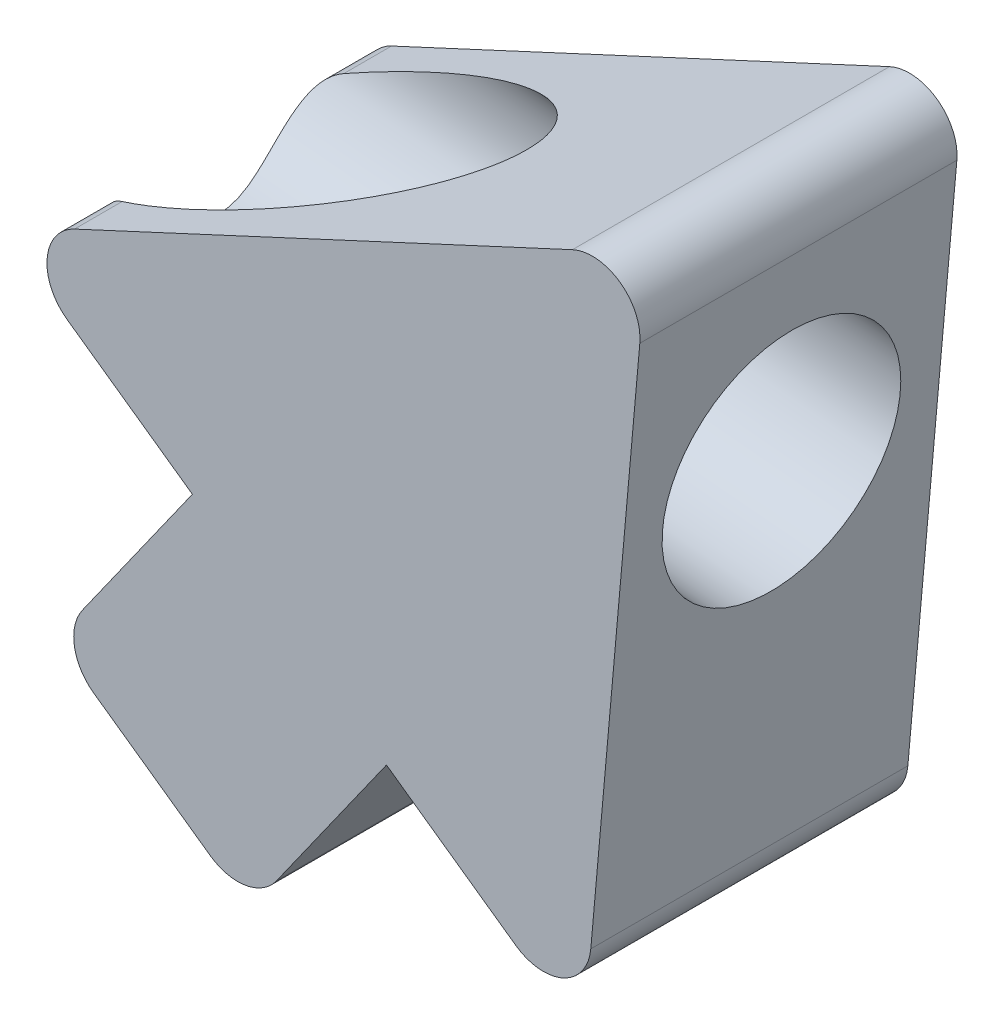
ISO-10303-21;
HEADER;
FILE_DESCRIPTION(('STEP AP214'),'2;1');
FILE_NAME('part.step','',(''),(''),'','','');
FILE_SCHEMA(('AUTOMOTIVE_DESIGN { 1 0 10303 214 1 1 1 1 }'));
ENDSEC;
DATA;
#1=APPLICATION_CONTEXT('core data for automotive mechanical design processes');
#2=APPLICATION_PROTOCOL_DEFINITION('international standard','automotive_design',2000,#1);
#3=PRODUCT_CONTEXT('',#1,'mechanical');
#4=PRODUCT('Part','Part','',(#3));
#5=PRODUCT_RELATED_PRODUCT_CATEGORY('part','',(#4));
#6=PRODUCT_DEFINITION_FORMATION('','',#4);
#7=PRODUCT_DEFINITION_CONTEXT('part definition',#1,'design');
#8=PRODUCT_DEFINITION('design','',#6,#7);
#9=PRODUCT_DEFINITION_SHAPE('','',#8);
#10=(LENGTH_UNIT() NAMED_UNIT(*) SI_UNIT(.MILLI.,.METRE.));
#11=(NAMED_UNIT(*) PLANE_ANGLE_UNIT() SI_UNIT($,.RADIAN.));
#12=(NAMED_UNIT(*) SI_UNIT($,.STERADIAN.) SOLID_ANGLE_UNIT());
#13=UNCERTAINTY_MEASURE_WITH_UNIT(LENGTH_MEASURE(1.E-05),#10,'distance_accuracy_value','');
#14=(GEOMETRIC_REPRESENTATION_CONTEXT(3) GLOBAL_UNCERTAINTY_ASSIGNED_CONTEXT((#13)) GLOBAL_UNIT_ASSIGNED_CONTEXT((#10,
#11,#12)) REPRESENTATION_CONTEXT('',''));
#15=CARTESIAN_POINT('',(0.,0.,0.));
#16=DIRECTION('',(0.,0.,1.));
#17=DIRECTION('',(1.,0.,0.));
#18=AXIS2_PLACEMENT_3D('',#15,#16,#17);
#19=CARTESIAN_POINT('',(0.,0.,5.08));
#20=DIRECTION('',(-0.996037458191655,0.0889347057065344,0.));
#21=DIRECTION('',(-0.0889347057065344,-0.996037458191655,0.));
#22=AXIS2_PLACEMENT_3D('',#19,#20,#21);
#23=PLANE('',#22);
#24=CARTESIAN_POINT('',(-0.388451027769523,-4.3505150352464,2.54));
#25=DIRECTION('',(0.996037458191655,-0.0889347057065344,0.));
#26=DIRECTION('',(0.0889347057065344,0.996037458191655,0.));
#27=AXIS2_PLACEMENT_3D('',#24,#25,#26);
#28=CIRCLE('',#27,1.905);
#29=CARTESIAN_POINT('',(-0.219030413398575,-2.45306367739129,2.54));
#30=VERTEX_POINT('',#29);
#31=EDGE_CURVE('E147',#30,#30,#28,.T.);
#32=ORIENTED_EDGE('',*,*,#31,.F.);
#33=EDGE_LOOP('',(#32));
#34=FACE_BOUND('',#33,.T.);
#35=DIRECTION('',(0.0889347057065344,0.996037458191655,0.));
#36=VECTOR('',#35,1.);
#37=CARTESIAN_POINT('',(0.,0.,5.08));
#38=LINE('',#37,#36);
#39=CARTESIAN_POINT('',(-0.902722254451116,-10.1101720934853,5.08));
#40=VERTEX_POINT('',#39);
#41=CARTESIAN_POINT('',(-0.117378044776006,-1.31459286267823,5.08));
#42=VERTEX_POINT('',#41);
#43=EDGE_CURVE('E190',#40,#42,#38,.T.);
#44=ORIENTED_EDGE('',*,*,#43,.F.);
#45=DIRECTION('',(0.,0.,-1.));
#46=VECTOR('',#45,1.);
#47=CARTESIAN_POINT('',(-0.902722254451116,-10.1101720934853,5.08));
#48=LINE('',#47,#46);
#49=CARTESIAN_POINT('',(-0.902722254451116,-10.1101720934853,0.));
#50=VERTEX_POINT('',#49);
#51=EDGE_CURVE('E181',#40,#50,#48,.T.);
#52=ORIENTED_EDGE('',*,*,#51,.T.);
#53=DIRECTION('',(0.0889347057065344,0.996037458191655,0.));
#54=VECTOR('',#53,1.);
#55=CARTESIAN_POINT('',(0.,0.,0.));
#56=LINE('',#55,#54);
#57=CARTESIAN_POINT('',(-0.117378044776006,-1.31459286267823,0.));
#58=VERTEX_POINT('',#57);
#59=EDGE_CURVE('E146',#50,#58,#56,.T.);
#60=ORIENTED_EDGE('',*,*,#59,.T.);
#61=DIRECTION('',(0.,0.,-1.));
#62=VECTOR('',#61,1.);
#63=CARTESIAN_POINT('',(-0.117378044776006,-1.31459286267823,5.08));
#64=LINE('',#63,#62);
#65=EDGE_CURVE('E179',#58,#42,#64,.F.);
#66=ORIENTED_EDGE('',*,*,#65,.T.);
#67=EDGE_LOOP('',(#44,#52,#60,#66));
#68=FACE_BOUND('',#67,.T.);
#69=ADVANCED_FACE('F36',(#34,#68),#23,.F.);
#70=CARTESIAN_POINT('',(0.,0.,5.08));
#71=DIRECTION('',(0.420999014675874,-0.907061094768122,0.));
#72=DIRECTION('',(0.907061094768122,0.420999014675874,0.));
#73=AXIS2_PLACEMENT_3D('',#70,#71,#72);
#74=PLANE('',#73);
#75=DIRECTION('',(0.,0.,-1.));
#76=VECTOR('',#75,1.);
#77=CARTESIAN_POINT('',(-9.17528756331665,-4.25857425238989,5.08));
#78=LINE('',#77,#76);
#79=CARTESIAN_POINT('',(-9.17528756331666,-4.25857425238989,0.));
#80=VERTEX_POINT('',#79);
#81=CARTESIAN_POINT('',(-9.17528756331665,-4.25857425238989,0.764304927774604));
#82=VERTEX_POINT('',#81);
#83=EDGE_CURVE('E145',#80,#82,#78,.F.);
#84=ORIENTED_EDGE('',*,*,#83,.T.);
#85=CARTESIAN_POINT('',(-7.92376410790863,-3.67769811889723,2.54));
#86=DIRECTION('',(0.420999014675874,-0.907061094768122,0.));
#87=DIRECTION('',(0.907061094768122,0.420999014675874,0.));
#88=AXIS2_PLACEMENT_3D('',#85,#86,#87);
#89=ELLIPSE('',#88,3.81000000000002,1.905);
#90=CARTESIAN_POINT('',(-9.17528756331665,-4.25857425238989,4.3156950722254));
#91=VERTEX_POINT('',#90);
#92=EDGE_CURVE('E55',#82,#91,#89,.T.);
#93=ORIENTED_EDGE('',*,*,#92,.T.);
#94=CARTESIAN_POINT('',(-9.17528756331666,-4.25857425238989,5.08));
#95=VERTEX_POINT('',#94);
#96=EDGE_CURVE('E142',#91,#95,#78,.F.);
#97=ORIENTED_EDGE('',*,*,#96,.T.);
#98=DIRECTION('',(-0.907061094768122,-0.420999014675874,0.));
#99=VECTOR('',#98,1.);
#100=CARTESIAN_POINT('',(0.,0.,5.08));
#101=LINE('',#100,#99);
#102=CARTESIAN_POINT('',(-1.19715983710106,-0.555644062716546,5.08));
#103=VERTEX_POINT('',#102);
#104=EDGE_CURVE('E235',#103,#95,#101,.T.);
#105=ORIENTED_EDGE('',*,*,#104,.F.);
#106=DIRECTION('',(0.,0.,-1.));
#107=VECTOR('',#106,1.);
#108=CARTESIAN_POINT('',(-1.19715983710106,-0.555644062716545,5.08));
#109=LINE('',#108,#107);
#110=CARTESIAN_POINT('',(-1.19715983710106,-0.555644062716546,0.));
#111=VERTEX_POINT('',#110);
#112=EDGE_CURVE('E153',#103,#111,#109,.T.);
#113=ORIENTED_EDGE('',*,*,#112,.T.);
#114=DIRECTION('',(-0.907061094768122,-0.420999014675874,0.));
#115=VECTOR('',#114,1.);
#116=CARTESIAN_POINT('',(0.,0.,0.));
#117=LINE('',#116,#115);
#118=EDGE_CURVE('E200',#111,#80,#117,.T.);
#119=ORIENTED_EDGE('',*,*,#118,.T.);
#120=EDGE_LOOP('',(#84,#93,#97,#105,#113,#119));
#121=FACE_BOUND('',#120,.T.);
#122=ADVANCED_FACE('F140',(#121),#74,.F.);
#123=CARTESIAN_POINT('',(-10.3677083131996,-4.81201873774523,5.08));
#124=DIRECTION('',(0.57784813420613,0.816144309417455,0.));
#125=DIRECTION('',(-0.816144309417455,0.57784813420613,0.));
#126=AXIS2_PLACEMENT_3D('',#123,#124,#125);
#127=PLANE('',#126);
#128=DIRECTION('',(0.816144309417455,-0.57784813420613,0.));
#129=VECTOR('',#128,1.);
#130=CARTESIAN_POINT('',(-10.3677083131996,-4.81201873774523,5.08));
#131=LINE('',#130,#129);
#132=CARTESIAN_POINT('',(-9.29480659239871,-5.5716567703793,5.08));
#133=VERTEX_POINT('',#132);
#134=CARTESIAN_POINT('',(-7.28600445573583,-6.99393289638509,5.08));
#135=VERTEX_POINT('',#134);
#136=EDGE_CURVE('E241',#133,#135,#131,.T.);
#137=ORIENTED_EDGE('',*,*,#136,.F.);
#138=DIRECTION('',(0.,0.,-1.));
#139=VECTOR('',#138,1.);
#140=CARTESIAN_POINT('',(-9.29480659239871,-5.5716567703793,5.08));
#141=LINE('',#140,#139);
#142=CARTESIAN_POINT('',(-9.29480659239871,-5.5716567703793,0.));
#143=VERTEX_POINT('',#142);
#144=EDGE_CURVE('E225',#133,#143,#141,.T.);
#145=ORIENTED_EDGE('',*,*,#144,.T.);
#146=DIRECTION('',(0.816144309417455,-0.57784813420613,0.));
#147=VECTOR('',#146,1.);
#148=CARTESIAN_POINT('',(-10.3677083131996,-4.81201873774523,0.));
#149=LINE('',#148,#147);
#150=CARTESIAN_POINT('',(-7.28600445573583,-6.99393289638509,0.));
#151=VERTEX_POINT('',#150);
#152=EDGE_CURVE('E202',#143,#151,#149,.T.);
#153=ORIENTED_EDGE('',*,*,#152,.T.);
#154=DIRECTION('',(0.,0.,-1.));
#155=VECTOR('',#154,1.);
#156=CARTESIAN_POINT('',(-7.28600445573583,-6.99393289638509,5.08));
#157=LINE('',#156,#155);
#158=EDGE_CURVE('E222',#135,#151,#157,.T.);
#159=ORIENTED_EDGE('',*,*,#158,.F.);
#160=EDGE_LOOP('',(#137,#145,#153,#159));
#161=FACE_BOUND('',#160,.T.);
#162=ADVANCED_FACE('F270',(#161),#127,.F.);
#163=CARTESIAN_POINT('',(-7.28600445573583,-6.99393289638509,5.08));
#164=DIRECTION('',(0.816144309417455,-0.57784813420613,0.));
#165=DIRECTION('',(0.57784813420613,0.816144309417455,0.));
#166=AXIS2_PLACEMENT_3D('',#163,#164,#165);
#167=PLANE('',#166);
#168=DIRECTION('',(-0.57784813420613,-0.816144309417455,0.));
#169=VECTOR('',#168,1.);
#170=CARTESIAN_POINT('',(-7.28600445573583,-6.99393289638509,0.));
#171=LINE('',#170,#169);
#172=CARTESIAN_POINT('',(-9.04728556879611,-9.4815407514895,0.));
#173=VERTEX_POINT('',#172);
#174=EDGE_CURVE('E209',#151,#173,#171,.T.);
#175=ORIENTED_EDGE('',*,*,#174,.T.);
#176=DIRECTION('',(0.,0.,-1.));
#177=VECTOR('',#176,1.);
#178=CARTESIAN_POINT('',(-9.04728556879611,-9.4815407514895,5.08));
#179=LINE('',#178,#177);
#180=CARTESIAN_POINT('',(-9.04728556879611,-9.4815407514895,5.08));
#181=VERTEX_POINT('',#180);
#182=EDGE_CURVE('E174',#173,#181,#179,.F.);
#183=ORIENTED_EDGE('',*,*,#182,.T.);
#184=DIRECTION('',(-0.57784813420613,-0.816144309417455,0.));
#185=VECTOR('',#184,1.);
#186=CARTESIAN_POINT('',(-7.28600445573583,-6.99393289638509,5.08));
#187=LINE('',#186,#185);
#188=EDGE_CURVE('E246',#135,#181,#187,.T.);
#189=ORIENTED_EDGE('',*,*,#188,.F.);
#190=ORIENTED_EDGE('',*,*,#158,.T.);
#191=EDGE_LOOP('',(#175,#183,#189,#190));
#192=FACE_BOUND('',#191,.T.);
#193=ADVANCED_FACE('F297',(#192),#167,.F.);
#194=CARTESIAN_POINT('',(-9.48760584706118,-10.1034427152656,5.08));
#195=DIRECTION('',(0.57784813420613,0.816144309417455,0.));
#196=DIRECTION('',(-0.816144309417455,0.57784813420613,0.));
#197=AXIS2_PLACEMENT_3D('',#194,#195,#196);
#198=PLANE('',#197);
#199=DIRECTION('',(0.816144309417455,-0.57784813420613,0.));
#200=VECTOR('',#199,1.);
#201=CARTESIAN_POINT('',(-9.48760584706118,-10.1034427152656,5.08));
#202=LINE('',#201,#200);
#203=CARTESIAN_POINT('',(-8.86570388328508,-10.5437629935307,5.08));
#204=VERTEX_POINT('',#203);
#205=CARTESIAN_POINT('',(-6.99999799195678,-11.8647238283259,5.08));
#206=VERTEX_POINT('',#205);
#207=EDGE_CURVE('E249',#204,#206,#202,.T.);
#208=ORIENTED_EDGE('',*,*,#207,.F.);
#209=DIRECTION('',(0.,0.,-1.));
#210=VECTOR('',#209,1.);
#211=CARTESIAN_POINT('',(-8.86570388328508,-10.5437629935307,5.08));
#212=LINE('',#211,#210);
#213=CARTESIAN_POINT('',(-8.86570388328508,-10.5437629935307,0.));
#214=VERTEX_POINT('',#213);
#215=EDGE_CURVE('E171',#204,#214,#212,.T.);
#216=ORIENTED_EDGE('',*,*,#215,.T.);
#217=DIRECTION('',(0.816144309417455,-0.57784813420613,0.));
#218=VECTOR('',#217,1.);
#219=CARTESIAN_POINT('',(-9.48760584706118,-10.1034427152656,0.));
#220=LINE('',#219,#218);
#221=CARTESIAN_POINT('',(-6.99999799195678,-11.8647238283259,0.));
#222=VERTEX_POINT('',#221);
#223=EDGE_CURVE('E212',#214,#222,#220,.T.);
#224=ORIENTED_EDGE('',*,*,#223,.T.);
#225=DIRECTION('',(0.,0.,-1.));
#226=VECTOR('',#225,1.);
#227=CARTESIAN_POINT('',(-6.99999799195678,-11.8647238283259,5.08));
#228=LINE('',#227,#226);
#229=EDGE_CURVE('E169',#222,#206,#228,.F.);
#230=ORIENTED_EDGE('',*,*,#229,.T.);
#231=EDGE_LOOP('',(#208,#216,#224,#230));
#232=FACE_BOUND('',#231,.T.);
#233=ADVANCED_FACE('F288',(#232),#198,.F.);
#234=CARTESIAN_POINT('',(-6.37809602818068,-12.305044106591,5.08));
#235=DIRECTION('',(-0.816144309417455,0.57784813420613,0.));
#236=DIRECTION('',(-0.57784813420613,-0.816144309417455,0.));
#237=AXIS2_PLACEMENT_3D('',#234,#235,#236);
#238=PLANE('',#237);
#239=DIRECTION('',(0.57784813420613,0.816144309417455,0.));
#240=VECTOR('',#239,1.);
#241=CARTESIAN_POINT('',(-6.37809602818068,-12.305044106591,5.08));
#242=LINE('',#241,#240);
#243=CARTESIAN_POINT('',(-5.93777574991561,-11.6831421428149,5.08));
#244=VERTEX_POINT('',#243);
#245=CARTESIAN_POINT('',(-4.17649463685533,-9.19553428771045,5.08));
#246=VERTEX_POINT('',#245);
#247=EDGE_CURVE('E251',#244,#246,#242,.T.);
#248=ORIENTED_EDGE('',*,*,#247,.F.);
#249=DIRECTION('',(0.,0.,-1.));
#250=VECTOR('',#249,1.);
#251=CARTESIAN_POINT('',(-5.93777574991561,-11.6831421428149,5.08));
#252=LINE('',#251,#250);
#253=CARTESIAN_POINT('',(-5.93777574991561,-11.6831421428149,0.));
#254=VERTEX_POINT('',#253);
#255=EDGE_CURVE('E176',#244,#254,#252,.T.);
#256=ORIENTED_EDGE('',*,*,#255,.T.);
#257=DIRECTION('',(0.57784813420613,0.816144309417455,0.));
#258=VECTOR('',#257,1.);
#259=CARTESIAN_POINT('',(-6.37809602818068,-12.305044106591,0.));
#260=LINE('',#259,#258);
#261=CARTESIAN_POINT('',(-4.17649463685533,-9.19553428771045,0.));
#262=VERTEX_POINT('',#261);
#263=EDGE_CURVE('E215',#254,#262,#260,.T.);
#264=ORIENTED_EDGE('',*,*,#263,.T.);
#265=DIRECTION('',(0.,0.,-1.));
#266=VECTOR('',#265,1.);
#267=CARTESIAN_POINT('',(-4.17649463685533,-9.19553428771045,5.08));
#268=LINE('',#267,#266);
#269=EDGE_CURVE('E219',#246,#262,#268,.T.);
#270=ORIENTED_EDGE('',*,*,#269,.F.);
#271=EDGE_LOOP('',(#248,#256,#264,#270));
#272=FACE_BOUND('',#271,.T.);
#273=ADVANCED_FACE('F293',(#272),#238,.F.);
#274=CARTESIAN_POINT('',(-4.17649463685533,-9.19553428771045,5.08));
#275=DIRECTION('',(0.57784813420613,0.816144309417455,0.));
#276=DIRECTION('',(-0.816144309417455,0.57784813420613,0.));
#277=AXIS2_PLACEMENT_3D('',#274,#275,#276);
#278=PLANE('',#277);
#279=DIRECTION('',(0.816144309417455,-0.57784813420613,0.));
#280=VECTOR('',#279,1.);
#281=CARTESIAN_POINT('',(-4.17649463685533,-9.19553428771045,0.));
#282=LINE('',#281,#280);
#283=CARTESIAN_POINT('',(-2.10202307585823,-10.664305811513,0.));
#284=VERTEX_POINT('',#283);
#285=EDGE_CURVE('E217',#262,#284,#282,.T.);
#286=ORIENTED_EDGE('',*,*,#285,.T.);
#287=DIRECTION('',(0.,0.,-1.));
#288=VECTOR('',#287,1.);
#289=CARTESIAN_POINT('',(-2.10202307585823,-10.664305811513,5.08));
#290=LINE('',#289,#288);
#291=CARTESIAN_POINT('',(-2.10202307585823,-10.664305811513,5.08));
#292=VERTEX_POINT('',#291);
#293=EDGE_CURVE('E50',#284,#292,#290,.F.);
#294=ORIENTED_EDGE('',*,*,#293,.T.);
#295=DIRECTION('',(0.816144309417455,-0.57784813420613,0.));
#296=VECTOR('',#295,1.);
#297=CARTESIAN_POINT('',(-4.17649463685533,-9.19553428771045,5.08));
#298=LINE('',#297,#296);
#299=EDGE_CURVE('E205',#246,#292,#298,.T.);
#300=ORIENTED_EDGE('',*,*,#299,.F.);
#301=ORIENTED_EDGE('',*,*,#269,.T.);
#302=EDGE_LOOP('',(#286,#294,#300,#301));
#303=FACE_BOUND('',#302,.T.);
#304=ADVANCED_FACE('F295',(#303),#278,.F.);
#305=CARTESIAN_POINT('',(0.,0.,5.08));
#306=DIRECTION('',(0.,0.,-1.));
#307=DIRECTION('',(-1.,0.,0.));
#308=AXIS2_PLACEMENT_3D('',#305,#306,#307);
#309=PLANE('',#308);
#310=ORIENTED_EDGE('',*,*,#104,.T.);
#311=CARTESIAN_POINT('',(-8.85448631413364,-4.9497548066032,5.08));
#312=DIRECTION('',(0.,0.,-1.));
#313=DIRECTION('',(-1.,0.,0.));
#314=AXIS2_PLACEMENT_3D('',#311,#312,#313);
#315=CIRCLE('',#314,0.762);
#316=EDGE_CURVE('E152',#95,#133,#315,.F.);
#317=ORIENTED_EDGE('',*,*,#316,.T.);
#318=ORIENTED_EDGE('',*,*,#136,.T.);
#319=ORIENTED_EDGE('',*,*,#188,.T.);
#320=CARTESIAN_POINT('',(-8.42538360502001,-9.92186102975457,5.08));
#321=DIRECTION('',(0.,0.,-1.));
#322=DIRECTION('',(-1.,0.,0.));
#323=AXIS2_PLACEMENT_3D('',#320,#321,#322);
#324=CIRCLE('',#323,0.762);
#325=EDGE_CURVE('E166',#181,#204,#324,.F.);
#326=ORIENTED_EDGE('',*,*,#325,.T.);
#327=ORIENTED_EDGE('',*,*,#207,.T.);
#328=CARTESIAN_POINT('',(-6.55967771369171,-11.2428218645498,5.08));
#329=DIRECTION('',(0.,0.,-1.));
#330=DIRECTION('',(-1.,0.,0.));
#331=AXIS2_PLACEMENT_3D('',#328,#329,#330);
#332=CIRCLE('',#331,0.762);
#333=EDGE_CURVE('E164',#206,#244,#332,.F.);
#334=ORIENTED_EDGE('',*,*,#333,.T.);
#335=ORIENTED_EDGE('',*,*,#247,.T.);
#336=ORIENTED_EDGE('',*,*,#299,.T.);
#337=CARTESIAN_POINT('',(-1.66170279759316,-10.0424038477369,5.08));
#338=DIRECTION('',(0.,0.,-1.));
#339=DIRECTION('',(-1.,0.,0.));
#340=AXIS2_PLACEMENT_3D('',#337,#338,#339);
#341=CIRCLE('',#340,0.762);
#342=EDGE_CURVE('E162',#292,#40,#341,.F.);
#343=ORIENTED_EDGE('',*,*,#342,.T.);
#344=ORIENTED_EDGE('',*,*,#43,.T.);
#345=CARTESIAN_POINT('',(-0.876358587918047,-1.24682461692985,5.08));
#346=DIRECTION('',(0.,0.,-1.));
#347=DIRECTION('',(-1.,0.,0.));
#348=AXIS2_PLACEMENT_3D('',#345,#346,#347);
#349=CIRCLE('',#348,0.762);
#350=EDGE_CURVE('E155',#42,#103,#349,.F.);
#351=ORIENTED_EDGE('',*,*,#350,.T.);
#352=EDGE_LOOP('',(#310,#317,#318,#319,#326,#327,#334,#335,#336,#343,#344,#351));
#353=FACE_BOUND('',#352,.T.);
#354=ADVANCED_FACE('F239',(#353),#309,.F.);
#355=CARTESIAN_POINT('',(0.,0.,0.));
#356=DIRECTION('',(0.,0.,-1.));
#357=DIRECTION('',(-1.,0.,0.));
#358=AXIS2_PLACEMENT_3D('',#355,#356,#357);
#359=PLANE('',#358);
#360=ORIENTED_EDGE('',*,*,#152,.F.);
#361=CARTESIAN_POINT('',(-8.85448631413364,-4.9497548066032,0.));
#362=DIRECTION('',(0.,0.,-1.));
#363=DIRECTION('',(-1.,0.,0.));
#364=AXIS2_PLACEMENT_3D('',#361,#362,#363);
#365=CIRCLE('',#364,0.762);
#366=EDGE_CURVE('E157',#143,#80,#365,.T.);
#367=ORIENTED_EDGE('',*,*,#366,.T.);
#368=ORIENTED_EDGE('',*,*,#118,.F.);
#369=CARTESIAN_POINT('',(-0.876358587918047,-1.24682461692985,0.));
#370=DIRECTION('',(0.,0.,-1.));
#371=DIRECTION('',(-1.,0.,0.));
#372=AXIS2_PLACEMENT_3D('',#369,#370,#371);
#373=CIRCLE('',#372,0.762);
#374=EDGE_CURVE('E199',#111,#58,#373,.T.);
#375=ORIENTED_EDGE('',*,*,#374,.T.);
#376=ORIENTED_EDGE('',*,*,#59,.F.);
#377=CARTESIAN_POINT('',(-1.66170279759316,-10.0424038477369,0.));
#378=DIRECTION('',(0.,0.,-1.));
#379=DIRECTION('',(-1.,0.,0.));
#380=AXIS2_PLACEMENT_3D('',#377,#378,#379);
#381=CIRCLE('',#380,0.762);
#382=EDGE_CURVE('E197',#50,#284,#381,.T.);
#383=ORIENTED_EDGE('',*,*,#382,.T.);
#384=ORIENTED_EDGE('',*,*,#285,.F.);
#385=ORIENTED_EDGE('',*,*,#263,.F.);
#386=CARTESIAN_POINT('',(-6.55967771369171,-11.2428218645498,0.));
#387=DIRECTION('',(0.,0.,-1.));
#388=DIRECTION('',(-1.,0.,0.));
#389=AXIS2_PLACEMENT_3D('',#386,#387,#388);
#390=CIRCLE('',#389,0.762);
#391=EDGE_CURVE('E230',#254,#222,#390,.T.);
#392=ORIENTED_EDGE('',*,*,#391,.T.);
#393=ORIENTED_EDGE('',*,*,#223,.F.);
#394=CARTESIAN_POINT('',(-8.42538360502001,-9.92186102975457,0.));
#395=DIRECTION('',(0.,0.,-1.));
#396=DIRECTION('',(-1.,0.,0.));
#397=AXIS2_PLACEMENT_3D('',#394,#395,#396);
#398=CIRCLE('',#397,0.762);
#399=EDGE_CURVE('E232',#214,#173,#398,.T.);
#400=ORIENTED_EDGE('',*,*,#399,.T.);
#401=ORIENTED_EDGE('',*,*,#174,.F.);
#402=EDGE_LOOP('',(#360,#367,#368,#375,#376,#383,#384,#385,#392,#393,#400,#401));
#403=FACE_BOUND('',#402,.T.);
#404=ADVANCED_FACE('F195',(#403),#359,.T.);
#405=CARTESIAN_POINT('',(-8.85448631413364,-4.9497548066032,5.08));
#406=DIRECTION('',(0.,0.,-1.));
#407=DIRECTION('',(-1.,0.,0.));
#408=AXIS2_PLACEMENT_3D('',#405,#406,#407);
#409=CYLINDRICAL_SURFACE('',#408,0.762);
#410=CARTESIAN_POINT('',(-9.17528756331665,-4.25857425238989,0.764304927774604));
#411=CARTESIAN_POINT('',(-9.1939067560444,-4.26721459939029,0.768292726082454));
#412=CARTESIAN_POINT('',(-9.21210127015178,-4.27657588265227,0.772645592521402));
#413=CARTESIAN_POINT('',(-9.2475264113705,-4.29662570031609,0.782124163837396));
#414=CARTESIAN_POINT('',(-9.26475727175556,-4.30731391147083,0.787249680557416));
#415=CARTESIAN_POINT('',(-9.31467698670627,-4.34108962189711,0.803796374467575));
#416=CARTESIAN_POINT('',(-9.34578354652675,-4.36597796075919,0.816427202661649));
#417=CARTESIAN_POINT('',(-9.40293342896509,-4.41930201214915,0.84506605696978));
#418=CARTESIAN_POINT('',(-9.42897763204229,-4.44773710640047,0.861073494802718));
#419=CARTESIAN_POINT('',(-9.47569107422918,-4.50684558392044,0.896448285879083));
#420=CARTESIAN_POINT('',(-9.49635800477675,-4.53751992132431,0.915817076284064));
#421=CARTESIAN_POINT('',(-9.53319623658612,-4.60130365587025,0.958692552181095));
#422=CARTESIAN_POINT('',(-9.54910675399917,-4.63445946375121,0.982352304234745));
#423=CARTESIAN_POINT('',(-9.5754837576823,-4.70060173560968,1.03272821441116));
#424=CARTESIAN_POINT('',(-9.58594613686951,-4.73358805332347,1.05944665987756));
#425=CARTESIAN_POINT('',(-9.60627988698853,-4.81543508392127,1.13016949048775));
#426=CARTESIAN_POINT('',(-9.61298622820673,-4.86358480550966,1.17591153834642));
#427=CARTESIAN_POINT('',(-9.61785787002289,-4.95540610838527,1.27205873523778));
#428=CARTESIAN_POINT('',(-9.6160066567121,-4.9990688649392,1.322472716143));
#429=CARTESIAN_POINT('',(-9.60389233575259,-5.10061202630193,1.45188341176475));
#430=CARTESIAN_POINT('',(-9.59003030482767,-5.15530803756366,1.53302090039259));
#431=CARTESIAN_POINT('',(-9.55582569196356,-5.25208162002466,1.70154118617569));
#432=CARTESIAN_POINT('',(-9.53545461327307,-5.29410209456598,1.78895010983886));
#433=CARTESIAN_POINT('',(-9.50452377517937,-5.34794713705857,1.92649304874375));
#434=CARTESIAN_POINT('',(-9.4938735142977,-5.36466057998862,1.9747374694208));
#435=CARTESIAN_POINT('',(-9.47374317831765,-5.39414591155595,2.07268481566935));
#436=CARTESIAN_POINT('',(-9.46426324923294,-5.40691730867085,2.12238792227482));
#437=CARTESIAN_POINT('',(-9.44772659313674,-5.428180660978,2.22270403558093));
#438=CARTESIAN_POINT('',(-9.4406516984933,-5.43670493802885,2.27330703683414));
#439=CARTESIAN_POINT('',(-9.42992568442698,-5.44933921123055,2.37541319552491));
#440=CARTESIAN_POINT('',(-9.42627232879378,-5.4534520907878,2.42691574259189));
#441=CARTESIAN_POINT('',(-9.42321622084964,-5.45689853785705,2.52488199019555));
#442=CARTESIAN_POINT('',(-9.42341374300086,-5.45668149618101,2.57131722935558));
#443=CARTESIAN_POINT('',(-9.42704851969521,-5.45256937792737,2.66388925629629));
#444=CARTESIAN_POINT('',(-9.43048631861784,-5.44867368332112,2.71002599261588));
#445=CARTESIAN_POINT('',(-9.44500031922137,-5.4315930415438,2.84788345454018));
#446=CARTESIAN_POINT('',(-9.46028523618981,-5.41299825051303,2.93852277399719));
#447=CARTESIAN_POINT('',(-9.48834594410976,-5.37306731982659,3.07962291553525));
#448=CARTESIAN_POINT('',(-9.49967839295167,-5.35580543427689,3.13164816773915));
#449=CARTESIAN_POINT('',(-9.52257461069328,-5.31692514136386,3.23399750417751));
#450=CARTESIAN_POINT('',(-9.53413842160786,-5.2953059361324,3.28432127488034));
#451=CARTESIAN_POINT('',(-9.56724976995345,-5.22422577252718,3.43234452172694));
#452=CARTESIAN_POINT('',(-9.58732130557714,-5.1684208581321,3.52751755662293));
#453=CARTESIAN_POINT('',(-9.60855153452326,-5.06628692285575,3.6729582007038));
#454=CARTESIAN_POINT('',(-9.61404957173685,-5.02492678944733,3.72610978900768));
#455=CARTESIAN_POINT('',(-9.61764450367405,-4.93699603222633,3.82826248845321));
#456=CARTESIAN_POINT('',(-9.61575043976406,-4.89043184126387,3.87726859503567));
#457=CARTESIAN_POINT('',(-9.60337445097024,-4.80383239438508,3.95995552448815));
#458=CARTESIAN_POINT('',(-9.59481150713342,-4.76452448540019,3.99467500074666));
#459=CARTESIAN_POINT('',(-9.57015886232621,-4.68482226930744,4.05995446207184));
#460=CARTESIAN_POINT('',(-9.5540806246061,-4.64442970478808,4.09052069084978));
#461=CARTESIAN_POINT('',(-9.51677842730064,-4.57105072561051,4.14213231230692));
#462=CARTESIAN_POINT('',(-9.49683374689968,-4.53793775216559,4.16391686795958));
#463=CARTESIAN_POINT('',(-9.45084365086509,-4.47377318152274,4.20374108251167));
#464=CARTESIAN_POINT('',(-9.4248029126775,-4.44272002717307,4.22178359272826));
#465=CARTESIAN_POINT('',(-9.36510256762157,-4.38246861185469,4.25501557668439));
#466=CARTESIAN_POINT('',(-9.33107826515457,-4.35349506836538,4.26996744823662));
#467=CARTESIAN_POINT('',(-9.27576261043552,-4.31438936586798,4.28932988318786));
#468=CARTESIAN_POINT('',(-9.25652691747219,-4.30204015564267,4.29529039701325));
#469=CARTESIAN_POINT('',(-9.21680495940407,-4.27901166938759,4.30622090481902));
#470=CARTESIAN_POINT('',(-9.19631824949504,-4.26833299218617,4.31119054377947));
#471=CARTESIAN_POINT('',(-9.17528756331665,-4.25857425238989,4.3156950722254));
#472=B_SPLINE_CURVE_WITH_KNOTS('',3,(#410,#411,#412,#413,#414,#415,#416,#417,#418,#419,#420,
#421,#422,#423,#424,#425,#426,#427,#428,#429,#430,#431,#432,#433,#434,#435,#436,#437,#438,#439,
#440,#441,#442,#443,#444,#445,#446,#447,#448,#449,#450,#451,#452,#453,#454,#455,#456,#457,#458,
#459,#460,#461,#462,#463,#464,#465,#466,#467,#468,#469,#470,#471),.UNSPECIFIED.,.F.,.F.,(4,2,2,
2,2,2,2,2,2,2,2,2,2,2,2,2,2,2,2,2,2,2,2,2,2,2,2,2,2,2,4),(0.,0.0626897533073942,
0.125364264894615,0.250078960078178,0.374771945084583,0.499518375082246,0.630202070983499,
0.760984140782011,0.960099081609653,1.15959842397424,1.45448880121449,1.75068832360022,
1.90701595242261,2.06336306542215,2.21850142753783,2.3735383251949,2.51257663926183,
2.65163831648805,2.93131901459312,3.09908698753512,3.26688570840045,3.60114501371063,
3.80332454542211,4.00525686649986,4.16409518239287,4.32269200525289,4.4552342100787,
4.58767504797233,4.72810101221799,4.79887115679227,4.86966661217209),.UNSPECIFIED.);
#473=EDGE_CURVE('E11',#82,#91,#472,.T.);
#474=ORIENTED_EDGE('',*,*,#473,.F.);
#475=ORIENTED_EDGE('',*,*,#83,.F.);
#476=ORIENTED_EDGE('',*,*,#366,.F.);
#477=ORIENTED_EDGE('',*,*,#144,.F.);
#478=ORIENTED_EDGE('',*,*,#316,.F.);
#479=ORIENTED_EDGE('',*,*,#96,.F.);
#480=EDGE_LOOP('',(#474,#475,#476,#477,#478,#479));
#481=FACE_BOUND('',#480,.T.);
#482=ADVANCED_FACE('F150',(#481),#409,.T.);
#483=CARTESIAN_POINT('',(-8.42538360502001,-9.92186102975457,5.08));
#484=DIRECTION('',(0.,0.,-1.));
#485=DIRECTION('',(-1.,0.,0.));
#486=AXIS2_PLACEMENT_3D('',#483,#484,#485);
#487=CYLINDRICAL_SURFACE('',#486,0.762);
#488=ORIENTED_EDGE('',*,*,#325,.F.);
#489=ORIENTED_EDGE('',*,*,#182,.F.);
#490=ORIENTED_EDGE('',*,*,#399,.F.);
#491=ORIENTED_EDGE('',*,*,#215,.F.);
#492=EDGE_LOOP('',(#488,#489,#490,#491));
#493=FACE_BOUND('',#492,.T.);
#494=ADVANCED_FACE('F261',(#493),#487,.T.);
#495=CARTESIAN_POINT('',(-6.55967771369171,-11.2428218645498,5.08));
#496=DIRECTION('',(0.,0.,-1.));
#497=DIRECTION('',(-1.,0.,0.));
#498=AXIS2_PLACEMENT_3D('',#495,#496,#497);
#499=CYLINDRICAL_SURFACE('',#498,0.762);
#500=ORIENTED_EDGE('',*,*,#333,.F.);
#501=ORIENTED_EDGE('',*,*,#229,.F.);
#502=ORIENTED_EDGE('',*,*,#391,.F.);
#503=ORIENTED_EDGE('',*,*,#255,.F.);
#504=EDGE_LOOP('',(#500,#501,#502,#503));
#505=FACE_BOUND('',#504,.T.);
#506=ADVANCED_FACE('F256',(#505),#499,.T.);
#507=CARTESIAN_POINT('',(-1.66170279759316,-10.0424038477369,5.08));
#508=DIRECTION('',(0.,0.,-1.));
#509=DIRECTION('',(-1.,0.,0.));
#510=AXIS2_PLACEMENT_3D('',#507,#508,#509);
#511=CYLINDRICAL_SURFACE('',#510,0.762);
#512=ORIENTED_EDGE('',*,*,#342,.F.);
#513=ORIENTED_EDGE('',*,*,#293,.F.);
#514=ORIENTED_EDGE('',*,*,#382,.F.);
#515=ORIENTED_EDGE('',*,*,#51,.F.);
#516=EDGE_LOOP('',(#512,#513,#514,#515));
#517=FACE_BOUND('',#516,.T.);
#518=ADVANCED_FACE('F254',(#517),#511,.T.);
#519=CARTESIAN_POINT('',(-0.876358587918047,-1.24682461692985,5.08));
#520=DIRECTION('',(0.,0.,-1.));
#521=DIRECTION('',(-1.,0.,0.));
#522=AXIS2_PLACEMENT_3D('',#519,#520,#521);
#523=CYLINDRICAL_SURFACE('',#522,0.762);
#524=ORIENTED_EDGE('',*,*,#350,.F.);
#525=ORIENTED_EDGE('',*,*,#65,.F.);
#526=ORIENTED_EDGE('',*,*,#374,.F.);
#527=ORIENTED_EDGE('',*,*,#112,.F.);
#528=EDGE_LOOP('',(#524,#525,#526,#527));
#529=FACE_BOUND('',#528,.T.);
#530=ADVANCED_FACE('F38',(#529),#523,.T.);
#531=CARTESIAN_POINT('',(-9.88593000050966,-3.50249923980819,2.54));
#532=DIRECTION('',(0.996037458191655,-0.0889347057065344,0.));
#533=DIRECTION('',(0.0889347057065344,0.996037458191655,0.));
#534=AXIS2_PLACEMENT_3D('',#531,#532,#533);
#535=CYLINDRICAL_SURFACE('',#534,1.905);
#536=ORIENTED_EDGE('',*,*,#31,.T.);
#537=EDGE_LOOP('',(#536));
#538=FACE_BOUND('',#537,.T.);
#539=ORIENTED_EDGE('',*,*,#473,.T.);
#540=ORIENTED_EDGE('',*,*,#92,.F.);
#541=EDGE_LOOP('',(#539,#540));
#542=FACE_BOUND('',#541,.T.);
#543=ADVANCED_FACE('F134',(#538,#542),#535,.F.);
#544=CLOSED_SHELL('',(#69,#122,#162,#193,#233,#273,#304,#354,#404,#482,#494,#506,#518,#530,#543));
#545=MANIFOLD_SOLID_BREP('B2',#544);
#546=ADVANCED_BREP_SHAPE_REPRESENTATION('',(#18,#545),#14);
#547=SHAPE_DEFINITION_REPRESENTATION(#9,#546);
ENDSEC;
END-ISO-10303-21;
